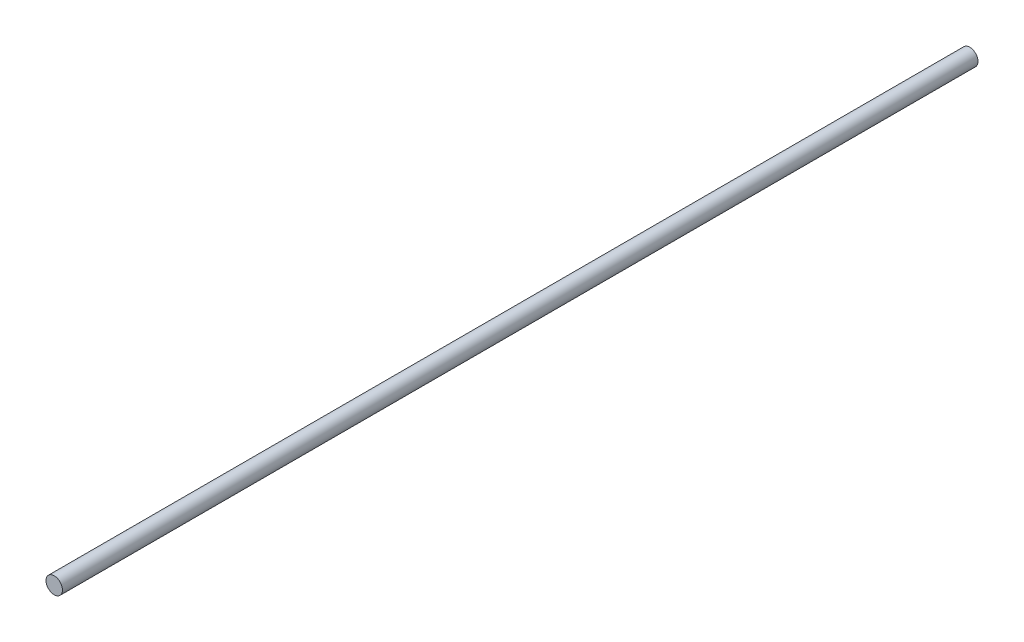
ISO-10303-21;
HEADER;
FILE_DESCRIPTION(('STEP AP214'),'2;1');
FILE_NAME('part.step','',(''),(''),'','','');
FILE_SCHEMA(('AUTOMOTIVE_DESIGN { 1 0 10303 214 1 1 1 1 }'));
ENDSEC;
DATA;
#1=APPLICATION_CONTEXT('core data for automotive mechanical design processes');
#2=APPLICATION_PROTOCOL_DEFINITION('international standard','automotive_design',2000,#1);
#3=PRODUCT_CONTEXT('',#1,'mechanical');
#4=PRODUCT('Part','Part','',(#3));
#5=PRODUCT_RELATED_PRODUCT_CATEGORY('part','',(#4));
#6=PRODUCT_DEFINITION_FORMATION('','',#4);
#7=PRODUCT_DEFINITION_CONTEXT('part definition',#1,'design');
#8=PRODUCT_DEFINITION('design','',#6,#7);
#9=PRODUCT_DEFINITION_SHAPE('','',#8);
#10=(LENGTH_UNIT() NAMED_UNIT(*) SI_UNIT(.MILLI.,.METRE.));
#11=(NAMED_UNIT(*) PLANE_ANGLE_UNIT() SI_UNIT($,.RADIAN.));
#12=(NAMED_UNIT(*) SI_UNIT($,.STERADIAN.) SOLID_ANGLE_UNIT());
#13=UNCERTAINTY_MEASURE_WITH_UNIT(LENGTH_MEASURE(1.E-05),#10,'distance_accuracy_value','');
#14=(GEOMETRIC_REPRESENTATION_CONTEXT(3) GLOBAL_UNCERTAINTY_ASSIGNED_CONTEXT((#13)) GLOBAL_UNIT_ASSIGNED_CONTEXT((#10,
#11,#12)) REPRESENTATION_CONTEXT('',''));
#15=CARTESIAN_POINT('',(0.,0.,0.));
#16=DIRECTION('',(0.,0.,1.));
#17=DIRECTION('',(1.,0.,0.));
#18=AXIS2_PLACEMENT_3D('',#15,#16,#17);
#19=CARTESIAN_POINT('',(0.,0.,2500.));
#20=DIRECTION('',(0.,0.,-1.));
#21=DIRECTION('',(-1.,0.,0.));
#22=AXIS2_PLACEMENT_3D('',#19,#20,#21);
#23=CYLINDRICAL_SURFACE('',#22,22.5);
#24=CARTESIAN_POINT('',(0.,0.,2500.));
#25=DIRECTION('',(0.,0.,1.));
#26=DIRECTION('',(1.,0.,0.));
#27=AXIS2_PLACEMENT_3D('',#24,#25,#26);
#28=CIRCLE('',#27,22.5);
#29=CARTESIAN_POINT('',(22.5,0.,2500.));
#30=VERTEX_POINT('',#29);
#31=EDGE_CURVE('E10',#30,#30,#28,.T.);
#32=ORIENTED_EDGE('',*,*,#31,.F.);
#33=EDGE_LOOP('',(#32));
#34=FACE_BOUND('',#33,.T.);
#35=CARTESIAN_POINT('',(0.,0.,0.));
#36=DIRECTION('',(0.,0.,1.));
#37=DIRECTION('',(1.,0.,0.));
#38=AXIS2_PLACEMENT_3D('',#35,#36,#37);
#39=CIRCLE('',#38,22.5);
#40=CARTESIAN_POINT('',(22.5,0.,0.));
#41=VERTEX_POINT('',#40);
#42=EDGE_CURVE('E40',#41,#41,#39,.T.);
#43=ORIENTED_EDGE('',*,*,#42,.T.);
#44=EDGE_LOOP('',(#43));
#45=FACE_BOUND('',#44,.T.);
#46=ADVANCED_FACE('F37',(#34,#45),#23,.T.);
#47=CARTESIAN_POINT('',(0.,0.,2500.));
#48=DIRECTION('',(0.,0.,1.));
#49=DIRECTION('',(1.,0.,0.));
#50=AXIS2_PLACEMENT_3D('',#47,#48,#49);
#51=PLANE('',#50);
#52=ORIENTED_EDGE('',*,*,#31,.T.);
#53=EDGE_LOOP('',(#52));
#54=FACE_BOUND('',#53,.T.);
#55=ADVANCED_FACE('F54',(#54),#51,.T.);
#56=CARTESIAN_POINT('',(0.,0.,0.));
#57=DIRECTION('',(0.,0.,1.));
#58=DIRECTION('',(1.,0.,0.));
#59=AXIS2_PLACEMENT_3D('',#56,#57,#58);
#60=PLANE('',#59);
#61=ORIENTED_EDGE('',*,*,#42,.F.);
#62=EDGE_LOOP('',(#61));
#63=FACE_BOUND('',#62,.T.);
#64=ADVANCED_FACE('F52',(#63),#60,.F.);
#65=CLOSED_SHELL('',(#46,#55,#64));
#66=MANIFOLD_SOLID_BREP('B2',#65);
#67=ADVANCED_BREP_SHAPE_REPRESENTATION('',(#18,#66),#14);
#68=SHAPE_DEFINITION_REPRESENTATION(#9,#67);
ENDSEC;
END-ISO-10303-21;
